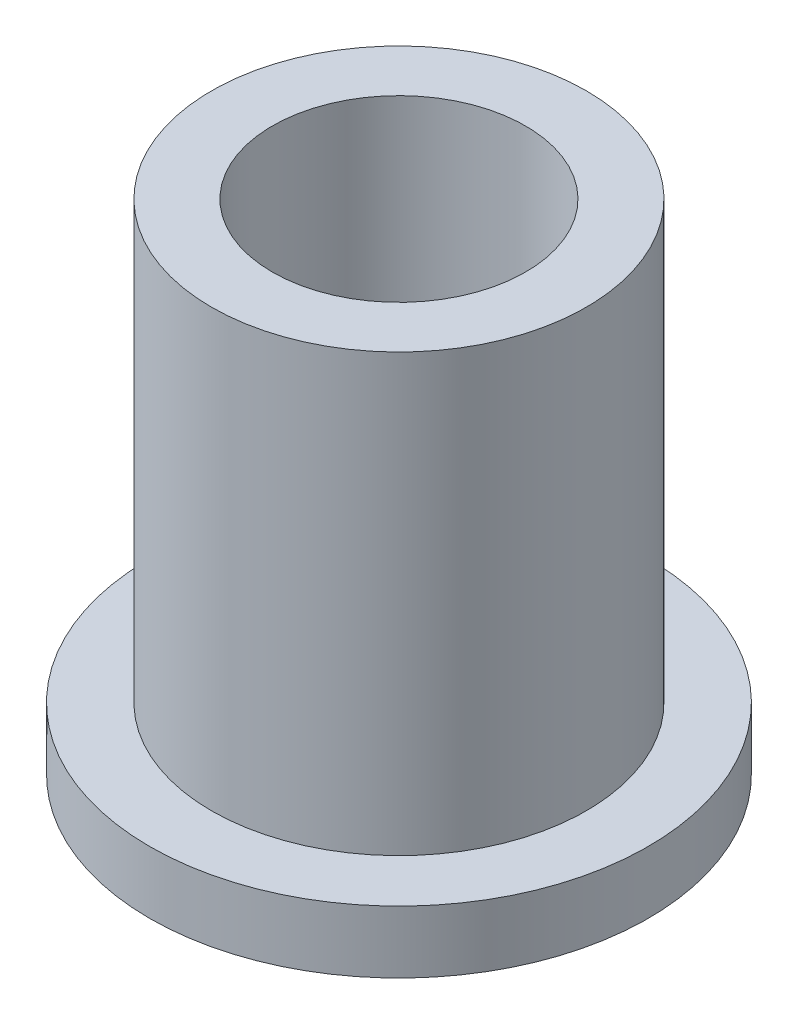
ISO-10303-21;
HEADER;
FILE_DESCRIPTION(('STEP AP214'),'2;1');
FILE_NAME('part.step','',(''),(''),'','','');
FILE_SCHEMA(('AUTOMOTIVE_DESIGN { 1 0 10303 214 1 1 1 1 }'));
ENDSEC;
DATA;
#1=APPLICATION_CONTEXT('core data for automotive mechanical design processes');
#2=APPLICATION_PROTOCOL_DEFINITION('international standard','automotive_design',2000,#1);
#3=PRODUCT_CONTEXT('',#1,'mechanical');
#4=PRODUCT('Part','Part','',(#3));
#5=PRODUCT_RELATED_PRODUCT_CATEGORY('part','',(#4));
#6=PRODUCT_DEFINITION_FORMATION('','',#4);
#7=PRODUCT_DEFINITION_CONTEXT('part definition',#1,'design');
#8=PRODUCT_DEFINITION('design','',#6,#7);
#9=PRODUCT_DEFINITION_SHAPE('','',#8);
#10=(LENGTH_UNIT() NAMED_UNIT(*) SI_UNIT(.MILLI.,.METRE.));
#11=(NAMED_UNIT(*) PLANE_ANGLE_UNIT() SI_UNIT($,.RADIAN.));
#12=(NAMED_UNIT(*) SI_UNIT($,.STERADIAN.) SOLID_ANGLE_UNIT());
#13=UNCERTAINTY_MEASURE_WITH_UNIT(LENGTH_MEASURE(1.E-05),#10,'distance_accuracy_value','');
#14=(GEOMETRIC_REPRESENTATION_CONTEXT(3) GLOBAL_UNCERTAINTY_ASSIGNED_CONTEXT((#13)) GLOBAL_UNIT_ASSIGNED_CONTEXT((#10,
#11,#12)) REPRESENTATION_CONTEXT('',''));
#15=CARTESIAN_POINT('',(0.,0.,0.));
#16=DIRECTION('',(0.,0.,1.));
#17=DIRECTION('',(1.,0.,0.));
#18=AXIS2_PLACEMENT_3D('',#15,#16,#17);
#19=CARTESIAN_POINT('',(0.,12.7,0.));
#20=DIRECTION('',(0.,1.,0.));
#21=DIRECTION('',(0.,0.,1.));
#22=AXIS2_PLACEMENT_3D('',#19,#20,#21);
#23=PLANE('',#22);
#24=CARTESIAN_POINT('',(0.,12.7,0.));
#25=DIRECTION('',(0.,1.,0.));
#26=DIRECTION('',(0.,0.,1.));
#27=AXIS2_PLACEMENT_3D('',#24,#25,#26);
#28=CIRCLE('',#27,4.7752);
#29=CARTESIAN_POINT('',(0.,12.7,4.7752));
#30=VERTEX_POINT('',#29);
#31=EDGE_CURVE('E10',#30,#30,#28,.T.);
#32=ORIENTED_EDGE('',*,*,#31,.T.);
#33=EDGE_LOOP('',(#32));
#34=FACE_BOUND('',#33,.T.);
#35=CARTESIAN_POINT('',(0.,12.7,0.));
#36=DIRECTION('',(0.,1.,0.));
#37=DIRECTION('',(0.,0.,1.));
#38=AXIS2_PLACEMENT_3D('',#35,#36,#37);
#39=CIRCLE('',#38,3.2258);
#40=CARTESIAN_POINT('',(0.,12.7,3.2258));
#41=VERTEX_POINT('',#40);
#42=EDGE_CURVE('E37',#41,#41,#39,.T.);
#43=ORIENTED_EDGE('',*,*,#42,.F.);
#44=EDGE_LOOP('',(#43));
#45=FACE_BOUND('',#44,.T.);
#46=ADVANCED_FACE('F30',(#34,#45),#23,.T.);
#47=CARTESIAN_POINT('',(0.,0.,0.));
#48=DIRECTION('',(0.,1.,0.));
#49=DIRECTION('',(0.,0.,1.));
#50=AXIS2_PLACEMENT_3D('',#47,#48,#49);
#51=PLANE('',#50);
#52=CARTESIAN_POINT('',(0.,0.,0.));
#53=DIRECTION('',(0.,1.,0.));
#54=DIRECTION('',(0.,0.,1.));
#55=AXIS2_PLACEMENT_3D('',#52,#53,#54);
#56=CIRCLE('',#55,3.2258);
#57=CARTESIAN_POINT('',(0.,0.,3.2258));
#58=VERTEX_POINT('',#57);
#59=EDGE_CURVE('E41',#58,#58,#56,.T.);
#60=ORIENTED_EDGE('',*,*,#59,.T.);
#61=EDGE_LOOP('',(#60));
#62=FACE_BOUND('',#61,.T.);
#63=CARTESIAN_POINT('',(0.,0.,0.));
#64=DIRECTION('',(0.,1.,0.));
#65=DIRECTION('',(0.,0.,1.));
#66=AXIS2_PLACEMENT_3D('',#63,#64,#65);
#67=CIRCLE('',#66,6.35);
#68=CARTESIAN_POINT('',(0.,0.,6.35));
#69=VERTEX_POINT('',#68);
#70=EDGE_CURVE('E48',#69,#69,#67,.T.);
#71=ORIENTED_EDGE('',*,*,#70,.F.);
#72=EDGE_LOOP('',(#71));
#73=FACE_BOUND('',#72,.T.);
#74=ADVANCED_FACE('F73',(#62,#73),#51,.F.);
#75=CARTESIAN_POINT('',(0.,12.7,0.));
#76=DIRECTION('',(0.,-1.,0.));
#77=DIRECTION('',(0.,0.,-1.));
#78=AXIS2_PLACEMENT_3D('',#75,#76,#77);
#79=CYLINDRICAL_SURFACE('',#78,4.7752);
#80=CARTESIAN_POINT('',(0.,1.5875,0.));
#81=DIRECTION('',(0.,1.,0.));
#82=DIRECTION('',(0.,0.,1.));
#83=AXIS2_PLACEMENT_3D('',#80,#81,#82);
#84=CIRCLE('',#83,4.7752);
#85=CARTESIAN_POINT('',(0.,1.5875,4.7752));
#86=VERTEX_POINT('',#85);
#87=EDGE_CURVE('E51',#86,#86,#84,.T.);
#88=ORIENTED_EDGE('',*,*,#87,.T.);
#89=EDGE_LOOP('',(#88));
#90=FACE_BOUND('',#89,.T.);
#91=ORIENTED_EDGE('',*,*,#31,.F.);
#92=EDGE_LOOP('',(#91));
#93=FACE_BOUND('',#92,.T.);
#94=ADVANCED_FACE('F32',(#90,#93),#79,.T.);
#95=CARTESIAN_POINT('',(0.,12.7,0.));
#96=DIRECTION('',(0.,-1.,0.));
#97=DIRECTION('',(0.,0.,-1.));
#98=AXIS2_PLACEMENT_3D('',#95,#96,#97);
#99=CYLINDRICAL_SURFACE('',#98,3.2258);
#100=ORIENTED_EDGE('',*,*,#42,.T.);
#101=EDGE_LOOP('',(#100));
#102=FACE_BOUND('',#101,.T.);
#103=ORIENTED_EDGE('',*,*,#59,.F.);
#104=EDGE_LOOP('',(#103));
#105=FACE_BOUND('',#104,.T.);
#106=ADVANCED_FACE('F62',(#102,#105),#99,.F.);
#107=CARTESIAN_POINT('',(0.,1.5875,0.));
#108=DIRECTION('',(0.,1.,0.));
#109=DIRECTION('',(0.,0.,1.));
#110=AXIS2_PLACEMENT_3D('',#107,#108,#109);
#111=PLANE('',#110);
#112=CARTESIAN_POINT('',(0.,1.5875,0.));
#113=DIRECTION('',(0.,1.,0.));
#114=DIRECTION('',(0.,0.,1.));
#115=AXIS2_PLACEMENT_3D('',#112,#113,#114);
#116=CIRCLE('',#115,6.35);
#117=CARTESIAN_POINT('',(0.,1.5875,6.35));
#118=VERTEX_POINT('',#117);
#119=EDGE_CURVE('E46',#118,#118,#116,.T.);
#120=ORIENTED_EDGE('',*,*,#119,.T.);
#121=EDGE_LOOP('',(#120));
#122=FACE_BOUND('',#121,.T.);
#123=ORIENTED_EDGE('',*,*,#87,.F.);
#124=EDGE_LOOP('',(#123));
#125=FACE_BOUND('',#124,.T.);
#126=ADVANCED_FACE('F59',(#122,#125),#111,.T.);
#127=CARTESIAN_POINT('',(0.,1.5875,0.));
#128=DIRECTION('',(0.,-1.,0.));
#129=DIRECTION('',(0.,0.,-1.));
#130=AXIS2_PLACEMENT_3D('',#127,#128,#129);
#131=CYLINDRICAL_SURFACE('',#130,6.35);
#132=ORIENTED_EDGE('',*,*,#119,.F.);
#133=EDGE_LOOP('',(#132));
#134=FACE_BOUND('',#133,.T.);
#135=ORIENTED_EDGE('',*,*,#70,.T.);
#136=EDGE_LOOP('',(#135));
#137=FACE_BOUND('',#136,.T.);
#138=ADVANCED_FACE('F61',(#134,#137),#131,.T.);
#139=CLOSED_SHELL('',(#46,#74,#94,#106,#126,#138));
#140=MANIFOLD_SOLID_BREP('B2',#139);
#141=ADVANCED_BREP_SHAPE_REPRESENTATION('',(#18,#140),#14);
#142=SHAPE_DEFINITION_REPRESENTATION(#9,#141);
ENDSEC;
END-ISO-10303-21;
